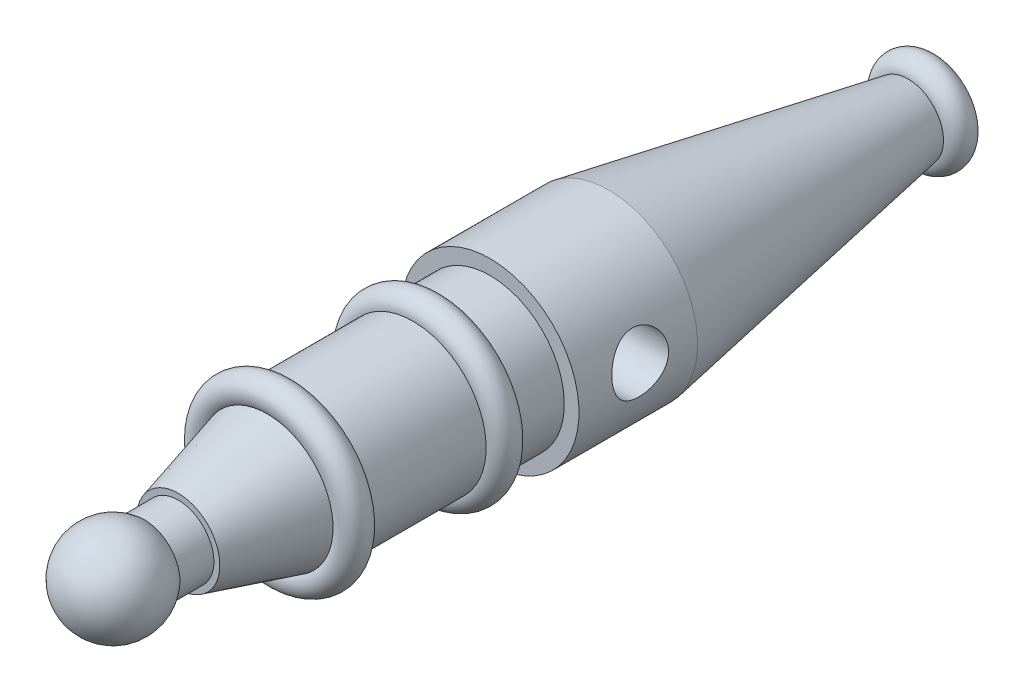
ISO-10303-21;
HEADER;
FILE_DESCRIPTION(('STEP AP214'),'2;1');
FILE_NAME('part.step','',(''),(''),'','','');
FILE_SCHEMA(('AUTOMOTIVE_DESIGN { 1 0 10303 214 1 1 1 1 }'));
ENDSEC;
DATA;
#1=APPLICATION_CONTEXT('core data for automotive mechanical design processes');
#2=APPLICATION_PROTOCOL_DEFINITION('international standard','automotive_design',2000,#1);
#3=PRODUCT_CONTEXT('',#1,'mechanical');
#4=PRODUCT('Part','Part','',(#3));
#5=PRODUCT_RELATED_PRODUCT_CATEGORY('part','',(#4));
#6=PRODUCT_DEFINITION_FORMATION('','',#4);
#7=PRODUCT_DEFINITION_CONTEXT('part definition',#1,'design');
#8=PRODUCT_DEFINITION('design','',#6,#7);
#9=PRODUCT_DEFINITION_SHAPE('','',#8);
#10=(LENGTH_UNIT() NAMED_UNIT(*) SI_UNIT(.MILLI.,.METRE.));
#11=(NAMED_UNIT(*) PLANE_ANGLE_UNIT() SI_UNIT($,.RADIAN.));
#12=(NAMED_UNIT(*) SI_UNIT($,.STERADIAN.) SOLID_ANGLE_UNIT());
#13=UNCERTAINTY_MEASURE_WITH_UNIT(LENGTH_MEASURE(1.E-05),#10,'distance_accuracy_value','');
#14=(GEOMETRIC_REPRESENTATION_CONTEXT(3) GLOBAL_UNCERTAINTY_ASSIGNED_CONTEXT((#13)) GLOBAL_UNIT_ASSIGNED_CONTEXT((#10,
#11,#12)) REPRESENTATION_CONTEXT('',''));
#15=CARTESIAN_POINT('',(0.,0.,0.));
#16=DIRECTION('',(0.,0.,1.));
#17=DIRECTION('',(1.,0.,0.));
#18=AXIS2_PLACEMENT_3D('',#15,#16,#17);
#19=CARTESIAN_POINT('',(0.,0.,-87.6024772147551));
#20=DIRECTION('',(0.,0.,-1.));
#21=DIRECTION('',(-1.,0.,0.));
#22=AXIS2_PLACEMENT_3D('',#19,#20,#21);
#23=TOROIDAL_SURFACE('',#22,5.80223071286831,2.5);
#24=CARTESIAN_POINT('',(0.,0.,-85.110312029807));
#25=DIRECTION('',(0.,0.,-1.));
#26=DIRECTION('',(-1.,0.,0.));
#27=AXIS2_PLACEMENT_3D('',#24,#25,#26);
#28=CIRCLE('',#27,6.);
#29=CARTESIAN_POINT('',(-6.,0.,-85.110312029807));
#30=VERTEX_POINT('',#29);
#31=EDGE_CURVE('E10',#30,#30,#28,.T.);
#32=ORIENTED_EDGE('',*,*,#31,.T.);
#33=EDGE_LOOP('',(#32));
#34=FACE_BOUND('',#33,.T.);
#35=CARTESIAN_POINT('',(0.,0.,-90.1024772147551));
#36=DIRECTION('',(0.,0.,-1.));
#37=DIRECTION('',(-1.,0.,0.));
#38=AXIS2_PLACEMENT_3D('',#35,#36,#37);
#39=CIRCLE('',#38,5.80223071286831);
#40=CARTESIAN_POINT('',(-5.80223071286831,0.,-90.1024772147551));
#41=VERTEX_POINT('',#40);
#42=EDGE_CURVE('E131',#41,#41,#39,.T.);
#43=ORIENTED_EDGE('',*,*,#42,.F.);
#44=EDGE_LOOP('',(#43));
#45=FACE_BOUND('',#44,.T.);
#46=ADVANCED_FACE('F37',(#34,#45),#23,.T.);
#47=CARTESIAN_POINT('',(0.,0.,-85.110312029807));
#48=DIRECTION('',(0.,0.,1.));
#49=DIRECTION('',(1.,0.,0.));
#50=AXIS2_PLACEMENT_3D('',#47,#48,#49);
#51=CONICAL_SURFACE('',#50,6.,0.176510713487807);
#52=CARTESIAN_POINT('',(0.,0.,-34.6618023353331));
#53=DIRECTION('',(0.,0.,-1.));
#54=DIRECTION('',(-1.,0.,0.));
#55=AXIS2_PLACEMENT_3D('',#52,#53,#54);
#56=CIRCLE('',#55,14.9983480623404);
#57=CARTESIAN_POINT('',(-14.9983480623404,0.,-34.6618023353331));
#58=VERTEX_POINT('',#57);
#59=EDGE_CURVE('E50',#58,#58,#56,.T.);
#60=ORIENTED_EDGE('',*,*,#59,.T.);
#61=EDGE_LOOP('',(#60));
#62=FACE_BOUND('',#61,.T.);
#63=ORIENTED_EDGE('',*,*,#31,.F.);
#64=EDGE_LOOP('',(#63));
#65=FACE_BOUND('',#64,.T.);
#66=ADVANCED_FACE('F119',(#62,#65),#51,.T.);
#67=CARTESIAN_POINT('',(0.,0.,-90.1024772147551));
#68=DIRECTION('',(0.,0.,-1.));
#69=DIRECTION('',(-1.,0.,0.));
#70=AXIS2_PLACEMENT_3D('',#67,#68,#69);
#71=CYLINDRICAL_SURFACE('',#70,14.9983480623404);
#72=CARTESIAN_POINT('',(-14.9983480623404,0.,-20.640024665117));
#73=CARTESIAN_POINT('',(-14.9983467366381,0.240707314815501,-20.5490765935883));
#74=CARTESIAN_POINT('',(-14.9925034352917,0.488832409299375,-20.4777441899989));
#75=CARTESIAN_POINT('',(-14.9675837474511,0.992705445884836,-20.3762339284068));
#76=CARTESIAN_POINT('',(-14.9485085902262,1.24845267776063,-20.3460522481816));
#77=CARTESIAN_POINT('',(-14.8969510765919,1.75992158233902,-20.3272346114657));
#78=CARTESIAN_POINT('',(-14.8644775176294,2.01564316188695,-20.3385714321522));
#79=CARTESIAN_POINT('',(-14.7873077792741,2.52014862353275,-20.4016101919568));
#80=CARTESIAN_POINT('',(-14.7426096800081,2.76893140911904,-20.4533184738115));
#81=CARTESIAN_POINT('',(-14.6425090854589,3.25739353602741,-20.5960404284727));
#82=CARTESIAN_POINT('',(-14.5869378364642,3.49684680009231,-20.6877061095937));
#83=CARTESIAN_POINT('',(-14.468995489268,3.95664345694216,-20.9073944061412));
#84=CARTESIAN_POINT('',(-14.4066224244438,4.17698128960344,-21.0354275538294));
#85=CARTESIAN_POINT('',(-14.2754528364286,4.60598513078304,-21.3328786360513));
#86=CARTESIAN_POINT('',(-14.2064934920029,4.81323682132875,-21.5042634277204));
#87=CARTESIAN_POINT('',(-14.0708427825407,5.19646006000511,-21.8801309800837));
#88=CARTESIAN_POINT('',(-14.0041522213361,5.372420613103,-22.084625326734));
#89=CARTESIAN_POINT('',(-13.9095060532902,5.61103245756441,-22.4151283455707));
#90=CARTESIAN_POINT('',(-13.8785157092543,5.68710582909876,-22.5308034514916));
#91=CARTESIAN_POINT('',(-13.8194614398048,5.82913662483071,-22.7688921748542));
#92=CARTESIAN_POINT('',(-13.7913962265015,5.8950985070344,-22.8913027901727));
#93=CARTESIAN_POINT('',(-13.7389629066828,6.01628699026198,-23.1420815291804));
#94=CARTESIAN_POINT('',(-13.7145947197784,6.07151382471885,-23.2704495232517));
#95=CARTESIAN_POINT('',(-13.6702924428232,6.17061562613777,-23.5321699649871));
#96=CARTESIAN_POINT('',(-13.6503559804879,6.21449666851939,-23.6655197010724));
#97=CARTESIAN_POINT('',(-13.616644032281,6.28800290448001,-23.92763579262));
#98=CARTESIAN_POINT('',(-13.6025587237996,6.31835398744148,-24.0561589174452));
#99=CARTESIAN_POINT('',(-13.5792549423986,6.36828403121501,-24.3156592424147));
#100=CARTESIAN_POINT('',(-13.5700341419484,6.38786814390949,-24.4466352378083));
#101=CARTESIAN_POINT('',(-13.5567407437599,6.41603214842148,-24.7099896055984));
#102=CARTESIAN_POINT('',(-13.5526667348856,6.42461505653438,-24.8423675835605));
#103=CARTESIAN_POINT('',(-13.549793758692,6.43067232241266,-25.1074316028834));
#104=CARTESIAN_POINT('',(-13.5509945027469,6.42814728798642,-25.2401176269913));
#105=CARTESIAN_POINT('',(-13.5583255425227,6.41266835778764,-25.4941112410029));
#106=CARTESIAN_POINT('',(-13.5640554628285,6.40056139155679,-25.6154831200395));
#107=CARTESIAN_POINT('',(-13.579794215506,6.3671010037414,-25.8567029943369));
#108=CARTESIAN_POINT('',(-13.5898044423353,6.34574456879405,-25.9765504798596));
#109=CARTESIAN_POINT('',(-13.6138408246279,6.29401265142525,-26.213837270517));
#110=CARTESIAN_POINT('',(-13.6278658095663,6.26363979769512,-26.3312772668892));
#111=CARTESIAN_POINT('',(-13.6595783859752,6.19417572783529,-26.5630583424691));
#112=CARTESIAN_POINT('',(-13.6772673865014,6.1550811571833,-26.6773982102857));
#113=CARTESIAN_POINT('',(-13.7357533136366,6.02401969580991,-27.0178147905912));
#114=CARTESIAN_POINT('',(-13.7816352952872,5.91896571525032,-27.23814374023));
#115=CARTESIAN_POINT('',(-13.8827717698308,5.67768725381195,-27.6584902780857));
#116=CARTESIAN_POINT('',(-13.938029532886,5.54145189142942,-27.8585007404066));
#117=CARTESIAN_POINT('',(-14.0586774318808,5.22824472231607,-28.2508946258523));
#118=CARTESIAN_POINT('',(-14.1245301966174,5.04877905889823,-28.4411474081266));
#119=CARTESIAN_POINT('',(-14.2571343387589,4.66115896881482,-28.7897004222714));
#120=CARTESIAN_POINT('',(-14.3238860511982,4.45299356298458,-28.9479883685148));
#121=CARTESIAN_POINT('',(-14.4227644171156,4.11692123689426,-29.1623358436357));
#122=CARTESIAN_POINT('',(-14.4563573584756,3.99753086124767,-29.2313739743013));
#123=CARTESIAN_POINT('',(-14.5217997888886,3.75283601812108,-29.3589689435328));
#124=CARTESIAN_POINT('',(-14.5536499250455,3.62753377834343,-29.4175296909374));
#125=CARTESIAN_POINT('',(-14.6150220735637,3.37177706228174,-29.5236767629971));
#126=CARTESIAN_POINT('',(-14.6445434569503,3.24132120823578,-29.5712601293961));
#127=CARTESIAN_POINT('',(-14.7007083013366,2.97623278424558,-29.6549384054679));
#128=CARTESIAN_POINT('',(-14.7273530839848,2.84160216930118,-29.6910386060252));
#129=CARTESIAN_POINT('',(-14.7766115280306,2.57299533799039,-29.7504890201732));
#130=CARTESIAN_POINT('',(-14.7993186451539,2.43911041597695,-29.7741741845132));
#131=CARTESIAN_POINT('',(-14.8412637930372,2.16932219472664,-29.8100012586003));
#132=CARTESIAN_POINT('',(-14.8605033092218,2.03341978685845,-29.8221481206063));
#133=CARTESIAN_POINT('',(-14.8952871723339,1.76061648277691,-29.8346888531423));
#134=CARTESIAN_POINT('',(-14.9108319415534,1.62371570251803,-29.8350840674711));
#135=CARTESIAN_POINT('',(-14.9380994641532,1.35001467095671,-29.8240100719876));
#136=CARTESIAN_POINT('',(-14.9498223922033,1.21321441534518,-29.8125414044907));
#137=CARTESIAN_POINT('',(-14.9688734289211,0.948608520678016,-29.7787427648205));
#138=CARTESIAN_POINT('',(-14.9764136501703,0.820733997311451,-29.7570679384257));
#139=CARTESIAN_POINT('',(-14.9881651450394,0.566996532561991,-29.7032816160109));
#140=CARTESIAN_POINT('',(-14.992375294301,0.441134284640879,-29.6711666001477));
#141=CARTESIAN_POINT('',(-14.9976286989251,0.192457777018517,-29.5967297226987));
#142=CARTESIAN_POINT('',(-14.9986733063479,0.0696422382502123,-29.5544122271168));
#143=CARTESIAN_POINT('',(-14.9978476863067,-0.17214462234157,-29.4598500212528));
#144=CARTESIAN_POINT('',(-14.9959763676304,-0.291114488009672,-29.407601600996));
#145=CARTESIAN_POINT('',(-14.9896749145594,-0.522825262889239,-29.2942953678712));
#146=CARTESIAN_POINT('',(-14.9852779357134,-0.635626527926144,-29.2333592497926));
#147=CARTESIAN_POINT('',(-14.9743148404398,-0.855875768862514,-29.1026241590072));
#148=CARTESIAN_POINT('',(-14.96774794358,-0.963321802676353,-29.0328220031116));
#149=CARTESIAN_POINT('',(-14.9453900687155,-1.2764919800864,-28.8108406580705));
#150=CARTESIAN_POINT('',(-14.9269350862279,-1.47325189455002,-28.6459866823462));
#151=CARTESIAN_POINT('',(-14.8859147387801,-1.8427397873714,-28.2818639963715));
#152=CARTESIAN_POINT('',(-14.8632453642498,-2.01460152238583,-28.0817332104961));
#153=CARTESIAN_POINT('',(-14.8181867295022,-2.32295162306069,-27.6557674201893));
#154=CARTESIAN_POINT('',(-14.7957975024461,-2.45943583807458,-27.4299294041418));
#155=CARTESIAN_POINT('',(-14.7546417759346,-2.69549626776774,-26.954034759535));
#156=CARTESIAN_POINT('',(-14.735951314654,-2.79433020688671,-26.7036025790878));
#157=CARTESIAN_POINT('',(-14.7059048890202,-2.94839403005375,-26.1892524929026));
#158=CARTESIAN_POINT('',(-14.6945479185828,-3.00362989556782,-25.9253364423847));
#159=CARTESIAN_POINT('',(-14.6811947172866,-3.06823330310079,-25.3956815886217));
#160=CARTESIAN_POINT('',(-14.6790624563037,-3.07826749357741,-25.1300275476668));
#161=CARTESIAN_POINT('',(-14.6841392083577,-3.05395611597648,-24.6008623334874));
#162=CARTESIAN_POINT('',(-14.6913477196759,-3.01961293152984,-24.3373510459348));
#163=CARTESIAN_POINT('',(-14.713775433627,-2.90833042950873,-23.8231228290833));
#164=CARTESIAN_POINT('',(-14.7288995309981,-2.83189627530385,-23.5722919596823));
#165=CARTESIAN_POINT('',(-14.7646665632117,-2.63905770834453,-23.0869078181862));
#166=CARTESIAN_POINT('',(-14.7853102805208,-2.52264762789772,-22.85235685989));
#167=CARTESIAN_POINT('',(-14.8291376441271,-2.25084746685166,-22.4020097756073));
#168=CARTESIAN_POINT('',(-14.852357304209,-2.09485109786066,-22.1865830553038));
#169=CARTESIAN_POINT('',(-14.8970349479798,-1.74903223059879,-21.7846147271802));
#170=CARTESIAN_POINT('',(-14.9184929092442,-1.55920930185295,-21.5980734870116));
#171=CARTESIAN_POINT('',(-14.9553108897748,-1.15328643440884,-21.261124719362));
#172=CARTESIAN_POINT('',(-14.9707432654845,-0.937541747957636,-21.1102975824118));
#173=CARTESIAN_POINT('',(-14.9922613681484,-0.483771657595213,-20.8461792445366));
#174=CARTESIAN_POINT('',(-14.9983494158254,-0.245751801448182,-20.7328787291223));
#175=CARTESIAN_POINT('',(-14.9983480623404,0.,-20.640024665117));
#176=B_SPLINE_CURVE_WITH_KNOTS('',3,(#72,#73,#74,#75,#76,#77,#78,#79,#80,#81,#82,#83,#84,#85,
#86,#87,#88,#89,#90,#91,#92,#93,#94,#95,#96,#97,#98,#99,#100,#101,#102,#103,#104,#105,#106,#107,
#108,#109,#110,#111,#112,#113,#114,#115,#116,#117,#118,#119,#120,#121,#122,#123,#124,#125,#126,
#127,#128,#129,#130,#131,#132,#133,#134,#135,#136,#137,#138,#139,#140,#141,#142,#143,#144,#145,
#146,#147,#148,#149,#150,#151,#152,#153,#154,#155,#156,#157,#158,#159,#160,#161,#162,#163,#164,
#165,#166,#167,#168,#169,#170,#171,#172,#173,#174,#175),.UNSPECIFIED.,.T.,.F.,(4,2,2,2,2,2,2,2,
2,2,2,2,2,2,2,2,2,2,2,2,2,2,2,2,2,2,2,2,2,2,2,2,2,2,2,2,2,2,2,2,2,2,2,2,2,2,2,2,2,2,2,4),(0.,
0.771022820297086,1.54197402043359,2.31241981433698,3.08298667689199,3.86662773671809,
4.65049597603543,5.47974716361737,6.30928915895146,6.73445706480571,7.15943697792877,
7.58440764885444,8.00915028392536,8.40703986110546,8.8047388862263,9.20232884742477,
9.59989705342347,9.96578971630705,10.3318016722801,10.697707023942,11.0637533524682,
11.8054434160543,12.547392706191,13.3530690608822,14.1590544889178,14.5844579642645,
15.0097024002073,15.4350613002719,15.8602239307937,16.2732336883189,16.686066101153,
17.0988513064877,17.5116176436404,17.9008973567104,18.2903084493003,18.6795531939038,
19.0689436385959,19.4533355290139,19.8378658204935,20.6062536424169,21.3970079538639,
22.1878549981413,22.9935730928354,23.7991806272893,24.5928670619062,25.3865108672131,
26.1708308700208,26.9552621178065,27.7525206992966,28.5497894273813,29.3371661014882,
30.1243471939734),.UNSPECIFIED.);
#177=CARTESIAN_POINT('',(-14.9983480623404,0.,-20.640024665117));
#178=VERTEX_POINT('',#177);
#179=EDGE_CURVE('E40',#178,#178,#176,.T.);
#180=ORIENTED_EDGE('',*,*,#179,.F.);
#181=EDGE_LOOP('',(#180));
#182=FACE_BOUND('',#181,.T.);
#183=CARTESIAN_POINT('',(14.904086487701,1.67888372624135,-29.8334298271253));
#184=CARTESIAN_POINT('',(14.8740751630078,1.94526640389676,-29.8334247511527));
#185=CARTESIAN_POINT('',(14.8368545569206,2.21088419021507,-29.8109440495972));
#186=CARTESIAN_POINT('',(14.7496770304638,2.73269014271645,-29.7226234916843));
#187=CARTESIAN_POINT('',(14.6997130308218,2.98887297672685,-29.6567595025405));
#188=CARTESIAN_POINT('',(14.5902078396806,3.48432669291777,-29.484735655049));
#189=CARTESIAN_POINT('',(14.5306908365509,3.72363814743085,-29.3786766715126));
#190=CARTESIAN_POINT('',(14.4058888600535,4.18054643286793,-29.1296511573217));
#191=CARTESIAN_POINT('',(14.340603026793,4.39814001623113,-28.9866791183398));
#192=CARTESIAN_POINT('',(14.2059827469059,4.81567061346776,-28.6606140280184));
#193=CARTESIAN_POINT('',(14.1365946252259,5.01445303750071,-28.4760654748443));
#194=CARTESIAN_POINT('',(14.0021173271889,5.37855750302494,-28.0747862409891));
#195=CARTESIAN_POINT('',(13.9370291808758,5.54387154672296,-27.8580478894526));
#196=CARTESIAN_POINT('',(13.8469029386457,5.76368925697278,-27.5115809193612));
#197=CARTESIAN_POINT('',(13.8179659225729,5.83258644131393,-27.3917716922025));
#198=CARTESIAN_POINT('',(13.7635162016186,5.95993755639448,-27.1460011444397));
#199=CARTESIAN_POINT('',(13.7380020071286,6.01839603374028,-27.0200425328073));
#200=CARTESIAN_POINT('',(13.6911402775357,6.12425326201847,-26.7628717389914));
#201=CARTESIAN_POINT('',(13.6697911789544,6.17165616426326,-26.6316615505018));
#202=CARTESIAN_POINT('',(13.6319117343938,6.25487981442608,-26.3649396855297));
#203=CARTESIAN_POINT('',(13.6153809241699,6.29070167821948,-26.2294284248537));
#204=CARTESIAN_POINT('',(13.5887280509564,6.34805773581515,-25.96555817794));
#205=CARTESIAN_POINT('',(13.5782176112734,6.37046360974842,-25.8374273969078));
#206=CARTESIAN_POINT('',(13.5621003785442,6.40470440556926,-25.579458912927));
#207=CARTESIAN_POINT('',(13.5564932048112,6.41654014811746,-25.449621343287));
#208=CARTESIAN_POINT('',(13.5503564463675,6.42948960369729,-25.1893384498213));
#209=CARTESIAN_POINT('',(13.5498250710259,6.43060709789375,-25.0588933565656));
#210=CARTESIAN_POINT('',(13.5538513559596,6.4221164477947,-24.7984363507619));
#211=CARTESIAN_POINT('',(13.5584088343853,6.4125086867654,-24.6684244229014));
#212=CARTESIAN_POINT('',(13.5719868635276,6.38371767737443,-24.418817490014));
#213=CARTESIAN_POINT('',(13.5806778029973,6.36524079691753,-24.2991226466287));
#214=CARTESIAN_POINT('',(13.6021147382088,6.3192997171568,-24.061828850566));
#215=CARTESIAN_POINT('',(13.6148620334879,6.29183263757616,-23.9442305823375));
#216=CARTESIAN_POINT('',(13.6587308996918,6.19633078026458,-23.5957996501447));
#217=CARTESIAN_POINT('',(13.6954915396879,6.11517099798785,-23.3691235020117));
#218=CARTESIAN_POINT('',(13.782014019154,5.91763715217173,-22.925561784532));
#219=CARTESIAN_POINT('',(13.8321542502313,5.80021935018844,-22.7092216212278));
#220=CARTESIAN_POINT('',(13.9405495565828,5.53462522923159,-22.2985450388232));
#221=CARTESIAN_POINT('',(13.9988077612802,5.38643703763382,-22.1042171579314));
#222=CARTESIAN_POINT('',(14.1243802685226,5.04851825870953,-21.725145449962));
#223=CARTESIAN_POINT('',(14.1920404157253,4.85628028156325,-21.542747710977));
#224=CARTESIAN_POINT('',(14.3264931443732,4.4439897128967,-21.2121848285071));
#225=CARTESIAN_POINT('',(14.3932854426487,4.22392828233566,-21.0640306060945));
#226=CARTESIAN_POINT('',(14.5237611387845,3.75142646774076,-20.8005401652371));
#227=CARTESIAN_POINT('',(14.587206858148,3.49803193537624,-20.6867877093115));
#228=CARTESIAN_POINT('',(14.7031804968906,2.97305661801344,-20.5047038875267));
#229=CARTESIAN_POINT('',(14.7557117325477,2.70148139033049,-20.4363587111202));
#230=CARTESIAN_POINT('',(14.8445481089819,2.15923057246629,-20.3501340307204));
#231=CARTESIAN_POINT('',(14.881417365024,1.8889519973192,-20.3303485393955));
#232=CARTESIAN_POINT('',(14.9401838211853,1.34738561498881,-20.3372872075967));
#233=CARTESIAN_POINT('',(14.9620861519414,1.07609818573488,-20.3639954180111));
#234=CARTESIAN_POINT('',(14.9902081212291,0.555475378609715,-20.4609985294335));
#235=CARTESIAN_POINT('',(14.9971927261961,0.305736233387765,-20.5289246024452));
#236=CARTESIAN_POINT('',(14.9992374890458,-0.179432011992068,-20.7044225630804));
#237=CARTESIAN_POINT('',(14.9942977386212,-0.414861222172275,-20.8119941458433));
#238=CARTESIAN_POINT('',(14.9751170485638,-0.864183603049782,-21.0633052015376));
#239=CARTESIAN_POINT('',(14.9609030063727,-1.07813699412589,-21.2069393464513));
#240=CARTESIAN_POINT('',(14.926532897415,-1.47978277257312,-21.5265735021391));
#241=CARTESIAN_POINT('',(14.9063757882111,-1.66747054432693,-21.7025791889703));
#242=CARTESIAN_POINT('',(14.8631431783365,-2.01730247045953,-22.0883344733308));
#243=CARTESIAN_POINT('',(14.8399961901643,-2.17846571703626,-22.2989663096911));
#244=CARTESIAN_POINT('',(14.7953319145299,-2.4636358072559,-22.7442133823089));
#245=CARTESIAN_POINT('',(14.7738147462745,-2.58763993499657,-22.9788303699239));
#246=CARTESIAN_POINT('',(14.7357492190285,-2.79635641074861,-23.4689465076497));
#247=CARTESIAN_POINT('',(14.7192682722839,-2.88054330598727,-23.7246752801128));
#248=CARTESIAN_POINT('',(14.6944515897062,-3.00459579680862,-24.2470355370985));
#249=CARTESIAN_POINT('',(14.6861146198641,-3.04446810724558,-24.5136653634678));
#250=CARTESIAN_POINT('',(14.6790627995705,-3.07828728798281,-25.0451570073691));
#251=CARTESIAN_POINT('',(14.6801788055512,-3.07304143833658,-25.3099653921169));
#252=CARTESIAN_POINT('',(14.6914436286276,-3.01872135916704,-25.8348400963094));
#253=CARTESIAN_POINT('',(14.7015923147802,-2.96964776499661,-26.0949064844411));
#254=CARTESIAN_POINT('',(14.729157918538,-2.82972463061699,-26.6011413695182));
#255=CARTESIAN_POINT('',(14.746523522989,-2.73916957278429,-26.8473943229569));
#256=CARTESIAN_POINT('',(14.7857189787931,-2.5190079875031,-27.3214013055463));
#257=CARTESIAN_POINT('',(14.8075494358349,-2.38939616059831,-27.5491528189834));
#258=CARTESIAN_POINT('',(14.8525315315577,-2.09182920106144,-27.9842900610828));
#259=CARTESIAN_POINT('',(14.8757002705395,-1.9232005038207,-28.191213694648));
#260=CARTESIAN_POINT('',(14.9188364357971,-1.55348769650694,-28.5741469961368));
#261=CARTESIAN_POINT('',(14.9388035587884,-1.352400515305,-28.7501537354983));
#262=CARTESIAN_POINT('',(14.9715279321173,-0.922209082090424,-29.066956248359));
#263=CARTESIAN_POINT('',(14.9842525543301,-0.6929836080085,-29.207591106925));
#264=CARTESIAN_POINT('',(14.9987322407259,-0.213879907612934,-29.4482568728785));
#265=CARTESIAN_POINT('',(15.0004935020212,0.0359865702803597,-29.5483106890614));
#266=CARTESIAN_POINT('',(14.9911182888336,0.517162553094589,-29.6951775419013));
#267=CARTESIAN_POINT('',(14.9815397954389,0.746980507469342,-29.7470213572609));
#268=CARTESIAN_POINT('',(14.9511847772516,1.21102308094972,-29.8161493351027));
#269=CARTESIAN_POINT('',(14.9304085057012,1.44524760028348,-29.8334342791061));
#270=CARTESIAN_POINT('',(14.904086487701,1.67888372624135,-29.8334298271253));
#271=B_SPLINE_CURVE_WITH_KNOTS('',3,(#183,#184,#185,#186,#187,#188,#189,#190,#191,#192,#193,
#194,#195,#196,#197,#198,#199,#200,#201,#202,#203,#204,#205,#206,#207,#208,#209,#210,#211,#212,
#213,#214,#215,#216,#217,#218,#219,#220,#221,#222,#223,#224,#225,#226,#227,#228,#229,#230,#231,
#232,#233,#234,#235,#236,#237,#238,#239,#240,#241,#242,#243,#244,#245,#246,#247,#248,#249,#250,
#251,#252,#253,#254,#255,#256,#257,#258,#259,#260,#261,#262,#263,#264,#265,#266,#267,#268,#269,
#270),.UNSPECIFIED.,.T.,.F.,(4,2,2,2,2,2,2,2,2,2,2,2,2,2,2,2,2,2,2,2,2,2,2,2,2,2,2,2,2,2,2,2,2,
2,2,2,2,2,2,2,2,2,2,4),(0.,0.803305251029093,1.60705773382861,2.40880630615135,3.21067458811587,
4.04686928643274,4.88326357131071,5.30641172377508,5.7293751209929,6.15217944097397,
6.57494301006429,6.96592324082397,7.35687311340068,7.74768506229348,8.13848304599751,
8.5023189540069,8.86627154192101,9.59355691788306,10.3441151608496,11.0949635434643,
11.9118491279578,12.7289948783311,13.5794467718409,14.4296398832868,15.2458873732893,
16.0618549144659,16.8348625915502,17.607864324592,18.3786340920362,19.1495391360523,
19.9445221577655,20.7395632693881,21.5448221103873,22.3499589163204,23.1407201375024,
23.9314698955289,24.7166909947779,25.5020186855389,26.3020758274645,27.1022087129296,
27.9059183042561,28.7091735521216,29.4137440327063,30.118298579811),.UNSPECIFIED.);
#272=CARTESIAN_POINT('',(14.904086487701,1.67888372624135,-29.8334298271253));
#273=VERTEX_POINT('',#272);
#274=EDGE_CURVE('E59',#273,#273,#271,.T.);
#275=ORIENTED_EDGE('',*,*,#274,.F.);
#276=EDGE_LOOP('',(#275));
#277=FACE_BOUND('',#276,.T.);
#278=CARTESIAN_POINT('',(0.,0.,-14.6618023353331));
#279=DIRECTION('',(0.,0.,-1.));
#280=DIRECTION('',(-1.,0.,0.));
#281=AXIS2_PLACEMENT_3D('',#278,#279,#280);
#282=CIRCLE('',#281,14.9983480623404);
#283=CARTESIAN_POINT('',(-14.9983480623404,0.,-14.6618023353331));
#284=VERTEX_POINT('',#283);
#285=EDGE_CURVE('E56',#284,#284,#282,.T.);
#286=ORIENTED_EDGE('',*,*,#285,.T.);
#287=EDGE_LOOP('',(#286));
#288=FACE_BOUND('',#287,.T.);
#289=ORIENTED_EDGE('',*,*,#59,.F.);
#290=EDGE_LOOP('',(#289));
#291=FACE_BOUND('',#290,.T.);
#292=ADVANCED_FACE('F65',(#182,#277,#288,#291),#71,.T.);
#293=CARTESIAN_POINT('',(0.,12.525406889019,-14.6618023353331));
#294=DIRECTION('',(0.,0.,1.));
#295=DIRECTION('',(1.,0.,0.));
#296=AXIS2_PLACEMENT_3D('',#293,#294,#295);
#297=PLANE('',#296);
#298=CARTESIAN_POINT('',(0.,0.,-14.6618023353331));
#299=DIRECTION('',(0.,0.,-1.));
#300=DIRECTION('',(-1.,0.,0.));
#301=AXIS2_PLACEMENT_3D('',#298,#299,#300);
#302=CIRCLE('',#301,12.525406889019);
#303=CARTESIAN_POINT('',(-12.525406889019,0.,-14.6618023353331));
#304=VERTEX_POINT('',#303);
#305=EDGE_CURVE('E170',#304,#304,#302,.T.);
#306=ORIENTED_EDGE('',*,*,#305,.T.);
#307=EDGE_LOOP('',(#306));
#308=FACE_BOUND('',#307,.T.);
#309=ORIENTED_EDGE('',*,*,#285,.F.);
#310=EDGE_LOOP('',(#309));
#311=FACE_BOUND('',#310,.T.);
#312=ADVANCED_FACE('F112',(#308,#311),#297,.T.);
#313=CARTESIAN_POINT('',(0.,0.,-90.1024772147551));
#314=DIRECTION('',(0.,0.,-1.));
#315=DIRECTION('',(-1.,0.,0.));
#316=AXIS2_PLACEMENT_3D('',#313,#314,#315);
#317=CYLINDRICAL_SURFACE('',#316,12.525406889019);
#318=CARTESIAN_POINT('',(0.,0.,-6.66180233533314));
#319=DIRECTION('',(0.,0.,-1.));
#320=DIRECTION('',(-1.,0.,0.));
#321=AXIS2_PLACEMENT_3D('',#318,#319,#320);
#322=CIRCLE('',#321,12.525406889019);
#323=CARTESIAN_POINT('',(-12.525406889019,0.,-6.66180233533314));
#324=VERTEX_POINT('',#323);
#325=EDGE_CURVE('E166',#324,#324,#322,.T.);
#326=ORIENTED_EDGE('',*,*,#325,.T.);
#327=EDGE_LOOP('',(#326));
#328=FACE_BOUND('',#327,.T.);
#329=ORIENTED_EDGE('',*,*,#305,.F.);
#330=EDGE_LOOP('',(#329));
#331=FACE_BOUND('',#330,.T.);
#332=ADVANCED_FACE('F109',(#328,#331),#317,.T.);
#333=CARTESIAN_POINT('',(0.,0.,-4.1619314406687));
#334=DIRECTION('',(0.,0.,-1.));
#335=DIRECTION('',(-1.,0.,0.));
#336=AXIS2_PLACEMENT_3D('',#333,#334,#335);
#337=TOROIDAL_SURFACE('',#336,12.5,2.5);
#338=CARTESIAN_POINT('',(0.,0.,-1.66682005805924));
#339=DIRECTION('',(0.,0.,-1.));
#340=DIRECTION('',(-1.,0.,0.));
#341=AXIS2_PLACEMENT_3D('',#338,#339,#340);
#342=CIRCLE('',#341,12.3437335980683);
#343=CARTESIAN_POINT('',(-12.3437335980683,0.,-1.66682005805924));
#344=VERTEX_POINT('',#343);
#345=EDGE_CURVE('E162',#344,#344,#342,.T.);
#346=ORIENTED_EDGE('',*,*,#345,.T.);
#347=EDGE_LOOP('',(#346));
#348=FACE_BOUND('',#347,.T.);
#349=ORIENTED_EDGE('',*,*,#325,.F.);
#350=EDGE_LOOP('',(#349));
#351=FACE_BOUND('',#350,.T.);
#352=ADVANCED_FACE('F105',(#348,#351),#337,.T.);
#353=CARTESIAN_POINT('',(0.,0.,-90.1024772147551));
#354=DIRECTION('',(0.,0.,-1.));
#355=DIRECTION('',(-1.,0.,0.));
#356=AXIS2_PLACEMENT_3D('',#353,#354,#355);
#357=CYLINDRICAL_SURFACE('',#356,12.3437335980683);
#358=CARTESIAN_POINT('',(0.,0.,18.3331799419408));
#359=DIRECTION('',(0.,0.,-1.));
#360=DIRECTION('',(-1.,0.,0.));
#361=AXIS2_PLACEMENT_3D('',#358,#359,#360);
#362=CIRCLE('',#361,12.3437335980683);
#363=CARTESIAN_POINT('',(-12.3437335980683,0.,18.3331799419408));
#364=VERTEX_POINT('',#363);
#365=EDGE_CURVE('E158',#364,#364,#362,.T.);
#366=ORIENTED_EDGE('',*,*,#365,.T.);
#367=EDGE_LOOP('',(#366));
#368=FACE_BOUND('',#367,.T.);
#369=ORIENTED_EDGE('',*,*,#345,.F.);
#370=EDGE_LOOP('',(#369));
#371=FACE_BOUND('',#370,.T.);
#372=ADVANCED_FACE('F101',(#368,#371),#357,.T.);
#373=CARTESIAN_POINT('',(0.,0.,20.8282913245502));
#374=DIRECTION('',(0.,0.,-1.));
#375=DIRECTION('',(-1.,0.,0.));
#376=AXIS2_PLACEMENT_3D('',#373,#374,#375);
#377=TOROIDAL_SURFACE('',#376,12.5,2.5);
#378=CARTESIAN_POINT('',(0.,0.,22.8975227852449));
#379=DIRECTION('',(0.,0.,-1.));
#380=DIRECTION('',(-1.,0.,0.));
#381=AXIS2_PLACEMENT_3D('',#378,#379,#380);
#382=CIRCLE('',#381,11.0970455595168);
#383=CARTESIAN_POINT('',(-11.0970455595168,0.,22.8975227852449));
#384=VERTEX_POINT('',#383);
#385=EDGE_CURVE('E154',#384,#384,#382,.T.);
#386=ORIENTED_EDGE('',*,*,#385,.T.);
#387=EDGE_LOOP('',(#386));
#388=FACE_BOUND('',#387,.T.);
#389=ORIENTED_EDGE('',*,*,#365,.F.);
#390=EDGE_LOOP('',(#389));
#391=FACE_BOUND('',#390,.T.);
#392=ADVANCED_FACE('F97',(#388,#391),#377,.T.);
#393=CARTESIAN_POINT('',(0.,0.,22.8975227852449));
#394=DIRECTION('',(0.,0.,-1.));
#395=DIRECTION('',(-1.,0.,0.));
#396=AXIS2_PLACEMENT_3D('',#393,#394,#395);
#397=CONICAL_SURFACE('',#396,11.0970455595168,0.266632785338239);
#398=CARTESIAN_POINT('',(0.,0.,37.8975227852449));
#399=DIRECTION('',(0.,0.,-1.));
#400=DIRECTION('',(-1.,0.,0.));
#401=AXIS2_PLACEMENT_3D('',#398,#399,#400);
#402=CIRCLE('',#401,7.);
#403=CARTESIAN_POINT('',(-7.,0.,37.8975227852449));
#404=VERTEX_POINT('',#403);
#405=EDGE_CURVE('E150',#404,#404,#402,.T.);
#406=ORIENTED_EDGE('',*,*,#405,.T.);
#407=EDGE_LOOP('',(#406));
#408=FACE_BOUND('',#407,.T.);
#409=ORIENTED_EDGE('',*,*,#385,.F.);
#410=EDGE_LOOP('',(#409));
#411=FACE_BOUND('',#410,.T.);
#412=ADVANCED_FACE('F93',(#408,#411),#397,.T.);
#413=CARTESIAN_POINT('',(0.,6.,37.8975227852449));
#414=DIRECTION('',(0.,0.,1.));
#415=DIRECTION('',(1.,0.,0.));
#416=AXIS2_PLACEMENT_3D('',#413,#414,#415);
#417=PLANE('',#416);
#418=CARTESIAN_POINT('',(0.,0.,37.8975227852449));
#419=DIRECTION('',(0.,0.,-1.));
#420=DIRECTION('',(-1.,0.,0.));
#421=AXIS2_PLACEMENT_3D('',#418,#419,#420);
#422=CIRCLE('',#421,6.);
#423=CARTESIAN_POINT('',(-6.,0.,37.8975227852449));
#424=VERTEX_POINT('',#423);
#425=EDGE_CURVE('E146',#424,#424,#422,.T.);
#426=ORIENTED_EDGE('',*,*,#425,.T.);
#427=EDGE_LOOP('',(#426));
#428=FACE_BOUND('',#427,.T.);
#429=ORIENTED_EDGE('',*,*,#405,.F.);
#430=EDGE_LOOP('',(#429));
#431=FACE_BOUND('',#430,.T.);
#432=ADVANCED_FACE('F89',(#428,#431),#417,.T.);
#433=CARTESIAN_POINT('',(0.,0.,-90.1024772147551));
#434=DIRECTION('',(0.,0.,-1.));
#435=DIRECTION('',(-1.,0.,0.));
#436=AXIS2_PLACEMENT_3D('',#433,#434,#435);
#437=CYLINDRICAL_SURFACE('',#436,6.);
#438=CARTESIAN_POINT('',(0.,0.,43.6060201631157));
#439=DIRECTION('',(0.,0.,-1.));
#440=DIRECTION('',(-1.,0.,0.));
#441=AXIS2_PLACEMENT_3D('',#438,#439,#440);
#442=CIRCLE('',#441,6.);
#443=CARTESIAN_POINT('',(-6.,0.,43.6060201631157));
#444=VERTEX_POINT('',#443);
#445=EDGE_CURVE('E139',#444,#444,#442,.T.);
#446=ORIENTED_EDGE('',*,*,#445,.T.);
#447=EDGE_LOOP('',(#446));
#448=FACE_BOUND('',#447,.T.);
#449=ORIENTED_EDGE('',*,*,#425,.F.);
#450=EDGE_LOOP('',(#449));
#451=FACE_BOUND('',#450,.T.);
#452=ADVANCED_FACE('F85',(#448,#451),#437,.T.);
#453=CARTESIAN_POINT('',(0.,0.,48.8975227852449));
#454=DIRECTION('',(0.,0.,-1.));
#455=DIRECTION('',(0.,1.,0.));
#456=AXIS2_PLACEMENT_3D('',#453,#454,#455);
#457=SPHERICAL_SURFACE('',#456,8.);
#458=ORIENTED_EDGE('',*,*,#445,.F.);
#459=EDGE_LOOP('',(#458));
#460=FACE_BOUND('',#459,.T.);
#461=ADVANCED_FACE('F81',(#460),#457,.T.);
#462=CARTESIAN_POINT('',(0.,0.,-40.1024772147551));
#463=DIRECTION('',(0.,0.,-1.));
#464=DIRECTION('',(-1.,0.,0.));
#465=AXIS2_PLACEMENT_3D('',#462,#463,#464);
#466=CYLINDRICAL_SURFACE('',#465,5.80223071286831);
#467=CARTESIAN_POINT('',(0.,0.,-40.1024772147551));
#468=DIRECTION('',(0.,0.,-1.));
#469=DIRECTION('',(-1.,0.,0.));
#470=AXIS2_PLACEMENT_3D('',#467,#468,#469);
#471=CIRCLE('',#470,5.80223071286831);
#472=CARTESIAN_POINT('',(-5.80223071286831,0.,-40.1024772147551));
#473=VERTEX_POINT('',#472);
#474=EDGE_CURVE('E134',#473,#473,#471,.T.);
#475=ORIENTED_EDGE('',*,*,#474,.F.);
#476=EDGE_LOOP('',(#475));
#477=FACE_BOUND('',#476,.T.);
#478=ORIENTED_EDGE('',*,*,#42,.T.);
#479=EDGE_LOOP('',(#478));
#480=FACE_BOUND('',#479,.T.);
#481=ADVANCED_FACE('F77',(#477,#480),#466,.F.);
#482=CARTESIAN_POINT('',(0.,0.,-40.1024772147551));
#483=DIRECTION('',(0.,0.,-1.));
#484=DIRECTION('',(-1.,0.,0.));
#485=AXIS2_PLACEMENT_3D('',#482,#483,#484);
#486=PLANE('',#485);
#487=ORIENTED_EDGE('',*,*,#474,.T.);
#488=EDGE_LOOP('',(#487));
#489=FACE_BOUND('',#488,.T.);
#490=ADVANCED_FACE('F72',(#489),#486,.T.);
#491=CARTESIAN_POINT('',(-15.,1.67888372624135,-25.0834298271253));
#492=DIRECTION('',(1.,0.,0.));
#493=DIRECTION('',(0.,0.,-1.));
#494=AXIS2_PLACEMENT_3D('',#491,#492,#493);
#495=CYLINDRICAL_SURFACE('',#494,4.75);
#496=ORIENTED_EDGE('',*,*,#179,.T.);
#497=EDGE_LOOP('',(#496));
#498=FACE_BOUND('',#497,.T.);
#499=ORIENTED_EDGE('',*,*,#274,.T.);
#500=EDGE_LOOP('',(#499));
#501=FACE_BOUND('',#500,.T.);
#502=ADVANCED_FACE('F68',(#498,#501),#495,.F.);
#503=CLOSED_SHELL('',(#46,#66,#292,#312,#332,#352,#372,#392,#412,#432,#452,#461,#481,#490,#502));
#504=MANIFOLD_SOLID_BREP('B2',#503);
#505=ADVANCED_BREP_SHAPE_REPRESENTATION('',(#18,#504),#14);
#506=SHAPE_DEFINITION_REPRESENTATION(#9,#505);
ENDSEC;
END-ISO-10303-21;
